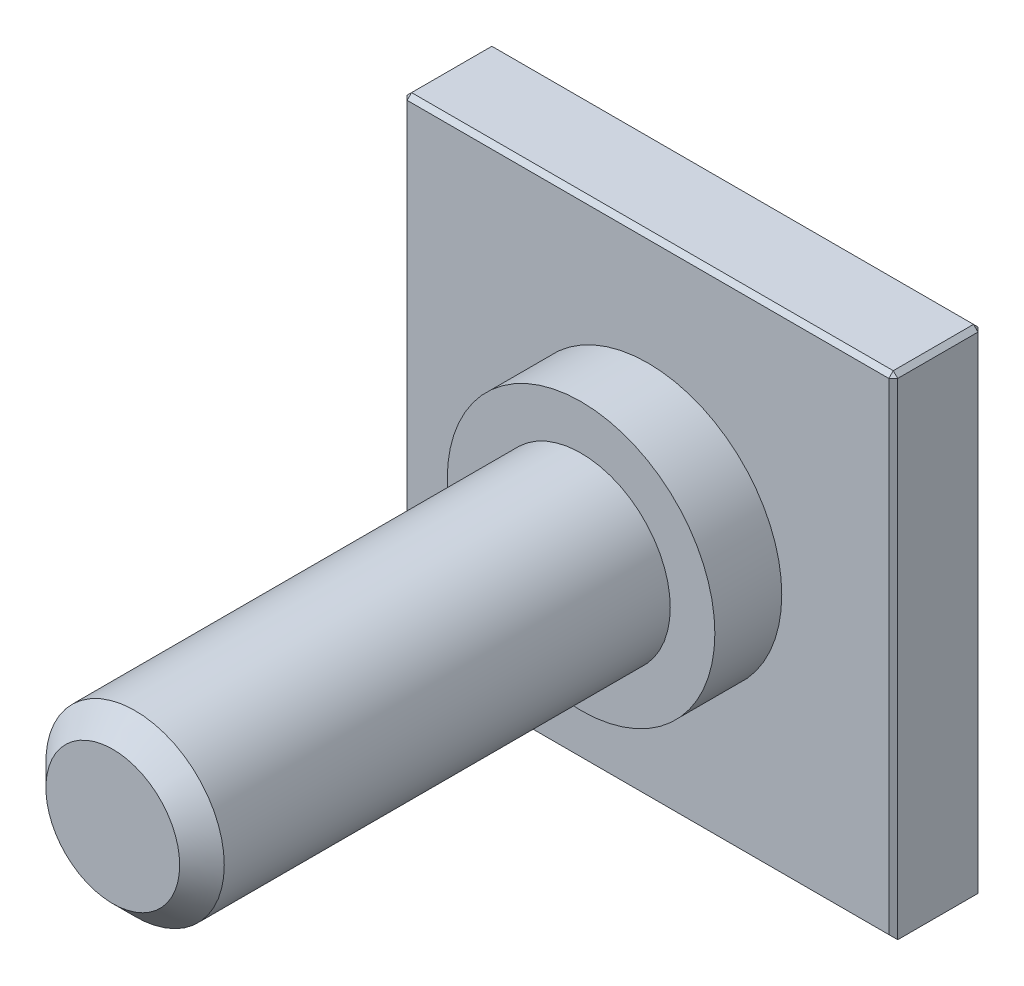
ISO-10303-21;
HEADER;
FILE_DESCRIPTION(('STEP AP214'),'2;1');
FILE_NAME('part.step','',(''),(''),'','','');
FILE_SCHEMA(('AUTOMOTIVE_DESIGN { 1 0 10303 214 1 1 1 1 }'));
ENDSEC;
DATA;
#1=APPLICATION_CONTEXT('core data for automotive mechanical design processes');
#2=APPLICATION_PROTOCOL_DEFINITION('international standard','automotive_design',2000,#1);
#3=PRODUCT_CONTEXT('',#1,'mechanical');
#4=PRODUCT('Part','Part','',(#3));
#5=PRODUCT_RELATED_PRODUCT_CATEGORY('part','',(#4));
#6=PRODUCT_DEFINITION_FORMATION('','',#4);
#7=PRODUCT_DEFINITION_CONTEXT('part definition',#1,'design');
#8=PRODUCT_DEFINITION('design','',#6,#7);
#9=PRODUCT_DEFINITION_SHAPE('','',#8);
#10=(LENGTH_UNIT() NAMED_UNIT(*) SI_UNIT(.MILLI.,.METRE.));
#11=(NAMED_UNIT(*) PLANE_ANGLE_UNIT() SI_UNIT($,.RADIAN.));
#12=(NAMED_UNIT(*) SI_UNIT($,.STERADIAN.) SOLID_ANGLE_UNIT());
#13=UNCERTAINTY_MEASURE_WITH_UNIT(LENGTH_MEASURE(1.E-05),#10,'distance_accuracy_value','');
#14=(GEOMETRIC_REPRESENTATION_CONTEXT(3) GLOBAL_UNCERTAINTY_ASSIGNED_CONTEXT((#13)) GLOBAL_UNIT_ASSIGNED_CONTEXT((#10,
#11,#12)) REPRESENTATION_CONTEXT('',''));
#15=CARTESIAN_POINT('',(0.,0.,0.));
#16=DIRECTION('',(0.,0.,1.));
#17=DIRECTION('',(1.,0.,0.));
#18=AXIS2_PLACEMENT_3D('',#15,#16,#17);
#19=CARTESIAN_POINT('',(5.5,-5.5,2.));
#20=DIRECTION('',(-1.,0.,0.));
#21=DIRECTION('',(0.,0.,1.));
#22=AXIS2_PLACEMENT_3D('',#19,#20,#21);
#23=PLANE('',#22);
#24=DIRECTION('',(0.,0.,-1.));
#25=VECTOR('',#24,1.);
#26=CARTESIAN_POINT('',(5.5,-5.5,2.));
#27=LINE('',#26,#25);
#28=CARTESIAN_POINT('',(5.5,-5.5,1.9));
#29=VERTEX_POINT('',#28);
#30=CARTESIAN_POINT('',(5.5,-5.5,0.100000000000001));
#31=VERTEX_POINT('',#30);
#32=EDGE_CURVE('E167',#29,#31,#27,.T.);
#33=ORIENTED_EDGE('',*,*,#32,.T.);
#34=DIRECTION('',(0.,1.,0.));
#35=VECTOR('',#34,1.);
#36=CARTESIAN_POINT('',(5.5,5.5,0.0999999999999994));
#37=LINE('',#36,#35);
#38=CARTESIAN_POINT('',(5.5,5.4,0.0999999999999994));
#39=VERTEX_POINT('',#38);
#40=EDGE_CURVE('E276',#31,#39,#37,.T.);
#41=ORIENTED_EDGE('',*,*,#40,.T.);
#42=DIRECTION('',(0.,0.,1.));
#43=VECTOR('',#42,1.);
#44=CARTESIAN_POINT('',(5.5,5.4,2.));
#45=LINE('',#44,#43);
#46=CARTESIAN_POINT('',(5.5,5.4,1.9));
#47=VERTEX_POINT('',#46);
#48=EDGE_CURVE('E273',#39,#47,#45,.T.);
#49=ORIENTED_EDGE('',*,*,#48,.T.);
#50=DIRECTION('',(0.,-1.,0.));
#51=VECTOR('',#50,1.);
#52=CARTESIAN_POINT('',(5.5,-5.5,1.9));
#53=LINE('',#52,#51);
#54=EDGE_CURVE('E269',#47,#29,#53,.T.);
#55=ORIENTED_EDGE('',*,*,#54,.T.);
#56=EDGE_LOOP('',(#33,#41,#49,#55));
#57=FACE_BOUND('',#56,.T.);
#58=ADVANCED_FACE('F34',(#57),#23,.F.);
#59=CARTESIAN_POINT('',(-5.5,5.5,2.));
#60=DIRECTION('',(0.,-1.,0.));
#61=DIRECTION('',(0.,0.,-1.));
#62=AXIS2_PLACEMENT_3D('',#59,#60,#61);
#63=PLANE('',#62);
#64=DIRECTION('',(1.,0.,0.));
#65=VECTOR('',#64,1.);
#66=CARTESIAN_POINT('',(-5.5,5.5,1.9));
#67=LINE('',#66,#65);
#68=CARTESIAN_POINT('',(-5.4,5.5,1.9));
#69=VERTEX_POINT('',#68);
#70=CARTESIAN_POINT('',(5.4,5.5,1.9));
#71=VERTEX_POINT('',#70);
#72=EDGE_CURVE('E120',#69,#71,#67,.T.);
#73=ORIENTED_EDGE('',*,*,#72,.T.);
#74=DIRECTION('',(0.,0.,-1.));
#75=VECTOR('',#74,1.);
#76=CARTESIAN_POINT('',(5.4,5.5,2.));
#77=LINE('',#76,#75);
#78=CARTESIAN_POINT('',(5.4,5.5,0.100000000000001));
#79=VERTEX_POINT('',#78);
#80=EDGE_CURVE('E116',#71,#79,#77,.T.);
#81=ORIENTED_EDGE('',*,*,#80,.T.);
#82=DIRECTION('',(-1.,0.,0.));
#83=VECTOR('',#82,1.);
#84=CARTESIAN_POINT('',(-5.5,5.5,0.100000000000001));
#85=LINE('',#84,#83);
#86=CARTESIAN_POINT('',(-5.4,5.5,0.100000000000001));
#87=VERTEX_POINT('',#86);
#88=EDGE_CURVE('E110',#79,#87,#85,.T.);
#89=ORIENTED_EDGE('',*,*,#88,.T.);
#90=DIRECTION('',(0.,0.,1.));
#91=VECTOR('',#90,1.);
#92=CARTESIAN_POINT('',(-5.4,5.5,2.));
#93=LINE('',#92,#91);
#94=EDGE_CURVE('E113',#87,#69,#93,.T.);
#95=ORIENTED_EDGE('',*,*,#94,.T.);
#96=EDGE_LOOP('',(#73,#81,#89,#95));
#97=FACE_BOUND('',#96,.T.);
#98=ADVANCED_FACE('F112',(#97),#63,.F.);
#99=CARTESIAN_POINT('',(-5.5,-5.5,2.));
#100=DIRECTION('',(1.,0.,0.));
#101=DIRECTION('',(0.,0.,-1.));
#102=AXIS2_PLACEMENT_3D('',#99,#100,#101);
#103=PLANE('',#102);
#104=DIRECTION('',(0.,0.,-1.));
#105=VECTOR('',#104,1.);
#106=CARTESIAN_POINT('',(-5.5,5.4,2.));
#107=LINE('',#106,#105);
#108=CARTESIAN_POINT('',(-5.5,5.4,1.9));
#109=VERTEX_POINT('',#108);
#110=CARTESIAN_POINT('',(-5.5,5.4,0.100000000000001));
#111=VERTEX_POINT('',#110);
#112=EDGE_CURVE('E49',#109,#111,#107,.T.);
#113=ORIENTED_EDGE('',*,*,#112,.T.);
#114=DIRECTION('',(0.,-1.,0.));
#115=VECTOR('',#114,1.);
#116=CARTESIAN_POINT('',(-5.5,-5.5,0.100000000000001));
#117=LINE('',#116,#115);
#118=CARTESIAN_POINT('',(-5.5,-5.5,0.100000000000001));
#119=VERTEX_POINT('',#118);
#120=EDGE_CURVE('E175',#111,#119,#117,.T.);
#121=ORIENTED_EDGE('',*,*,#120,.T.);
#122=DIRECTION('',(0.,0.,-1.));
#123=VECTOR('',#122,1.);
#124=CARTESIAN_POINT('',(-5.5,-5.5,2.));
#125=LINE('',#124,#123);
#126=CARTESIAN_POINT('',(-5.5,-5.5,1.9));
#127=VERTEX_POINT('',#126);
#128=EDGE_CURVE('E131',#127,#119,#125,.T.);
#129=ORIENTED_EDGE('',*,*,#128,.F.);
#130=DIRECTION('',(0.,1.,0.));
#131=VECTOR('',#130,1.);
#132=CARTESIAN_POINT('',(-5.5,-5.5,1.9));
#133=LINE('',#132,#131);
#134=EDGE_CURVE('E54',#127,#109,#133,.T.);
#135=ORIENTED_EDGE('',*,*,#134,.T.);
#136=EDGE_LOOP('',(#113,#121,#129,#135));
#137=FACE_BOUND('',#136,.T.);
#138=ADVANCED_FACE('F196',(#137),#103,.F.);
#139=CARTESIAN_POINT('',(-5.5,-5.5,2.));
#140=DIRECTION('',(0.,1.,0.));
#141=DIRECTION('',(0.,0.,1.));
#142=AXIS2_PLACEMENT_3D('',#139,#140,#141);
#143=PLANE('',#142);
#144=ORIENTED_EDGE('',*,*,#128,.T.);
#145=DIRECTION('',(1.,0.,0.));
#146=VECTOR('',#145,1.);
#147=CARTESIAN_POINT('',(5.5,-5.5,0.100000000000001));
#148=LINE('',#147,#146);
#149=EDGE_CURVE('E294',#119,#31,#148,.T.);
#150=ORIENTED_EDGE('',*,*,#149,.T.);
#151=ORIENTED_EDGE('',*,*,#32,.F.);
#152=DIRECTION('',(-1.,0.,0.));
#153=VECTOR('',#152,1.);
#154=CARTESIAN_POINT('',(-5.5,-5.5,1.9));
#155=LINE('',#154,#153);
#156=EDGE_CURVE('E292',#29,#127,#155,.T.);
#157=ORIENTED_EDGE('',*,*,#156,.T.);
#158=EDGE_LOOP('',(#144,#150,#151,#157));
#159=FACE_BOUND('',#158,.T.);
#160=ADVANCED_FACE('F325',(#159),#143,.F.);
#161=CARTESIAN_POINT('',(0.,0.,2.));
#162=DIRECTION('',(0.,0.,-1.));
#163=DIRECTION('',(-1.,0.,0.));
#164=AXIS2_PLACEMENT_3D('',#161,#162,#163);
#165=PLANE('',#164);
#166=CARTESIAN_POINT('',(0.,0.,2.));
#167=DIRECTION('',(0.,0.,-1.));
#168=DIRECTION('',(-1.,0.,0.));
#169=AXIS2_PLACEMENT_3D('',#166,#167,#168);
#170=CIRCLE('',#169,3.);
#171=CARTESIAN_POINT('',(-3.,0.,2.));
#172=VERTEX_POINT('',#171);
#173=EDGE_CURVE('E173',#172,#172,#170,.F.);
#174=ORIENTED_EDGE('',*,*,#173,.F.);
#175=EDGE_LOOP('',(#174));
#176=FACE_BOUND('',#175,.T.);
#177=DIRECTION('',(0.,1.,0.));
#178=VECTOR('',#177,1.);
#179=CARTESIAN_POINT('',(5.4,0.,2.));
#180=LINE('',#179,#178);
#181=CARTESIAN_POINT('',(5.4,-5.4,2.));
#182=VERTEX_POINT('',#181);
#183=CARTESIAN_POINT('',(5.4,5.4,2.));
#184=VERTEX_POINT('',#183);
#185=EDGE_CURVE('E278',#182,#184,#180,.T.);
#186=ORIENTED_EDGE('',*,*,#185,.T.);
#187=DIRECTION('',(-1.,0.,0.));
#188=VECTOR('',#187,1.);
#189=CARTESIAN_POINT('',(0.,5.4,2.));
#190=LINE('',#189,#188);
#191=CARTESIAN_POINT('',(-5.4,5.4,2.));
#192=VERTEX_POINT('',#191);
#193=EDGE_CURVE('E283',#184,#192,#190,.T.);
#194=ORIENTED_EDGE('',*,*,#193,.T.);
#195=DIRECTION('',(0.,-1.,0.));
#196=VECTOR('',#195,1.);
#197=CARTESIAN_POINT('',(-5.4,0.,2.));
#198=LINE('',#197,#196);
#199=CARTESIAN_POINT('',(-5.4,-5.4,2.));
#200=VERTEX_POINT('',#199);
#201=EDGE_CURVE('E260',#192,#200,#198,.T.);
#202=ORIENTED_EDGE('',*,*,#201,.T.);
#203=DIRECTION('',(1.,0.,0.));
#204=VECTOR('',#203,1.);
#205=CARTESIAN_POINT('',(0.,-5.4,2.));
#206=LINE('',#205,#204);
#207=EDGE_CURVE('E280',#200,#182,#206,.T.);
#208=ORIENTED_EDGE('',*,*,#207,.T.);
#209=EDGE_LOOP('',(#186,#194,#202,#208));
#210=FACE_BOUND('',#209,.T.);
#211=ADVANCED_FACE('F254',(#176,#210),#165,.F.);
#212=CARTESIAN_POINT('',(0.,0.,0.));
#213=DIRECTION('',(0.,0.,-1.));
#214=DIRECTION('',(-1.,0.,0.));
#215=AXIS2_PLACEMENT_3D('',#212,#213,#214);
#216=PLANE('',#215);
#217=DIRECTION('',(0.,1.,0.));
#218=VECTOR('',#217,1.);
#219=CARTESIAN_POINT('',(-5.4,5.5,0.));
#220=LINE('',#219,#218);
#221=CARTESIAN_POINT('',(-5.4,-5.4,0.));
#222=VERTEX_POINT('',#221);
#223=CARTESIAN_POINT('',(-5.4,5.4,0.));
#224=VERTEX_POINT('',#223);
#225=EDGE_CURVE('E285',#222,#224,#220,.T.);
#226=ORIENTED_EDGE('',*,*,#225,.T.);
#227=DIRECTION('',(1.,0.,0.));
#228=VECTOR('',#227,1.);
#229=CARTESIAN_POINT('',(5.5,5.4,0.));
#230=LINE('',#229,#228);
#231=CARTESIAN_POINT('',(5.4,5.4,0.));
#232=VERTEX_POINT('',#231);
#233=EDGE_CURVE('E143',#224,#232,#230,.T.);
#234=ORIENTED_EDGE('',*,*,#233,.T.);
#235=DIRECTION('',(0.,-1.,0.));
#236=VECTOR('',#235,1.);
#237=CARTESIAN_POINT('',(5.4,-5.5,0.));
#238=LINE('',#237,#236);
#239=CARTESIAN_POINT('',(5.4,-5.4,0.));
#240=VERTEX_POINT('',#239);
#241=EDGE_CURVE('E289',#232,#240,#238,.T.);
#242=ORIENTED_EDGE('',*,*,#241,.T.);
#243=DIRECTION('',(-1.,0.,0.));
#244=VECTOR('',#243,1.);
#245=CARTESIAN_POINT('',(-5.5,-5.4,0.));
#246=LINE('',#245,#244);
#247=EDGE_CURVE('E287',#240,#222,#246,.T.);
#248=ORIENTED_EDGE('',*,*,#247,.T.);
#249=EDGE_LOOP('',(#226,#234,#242,#248));
#250=FACE_BOUND('',#249,.T.);
#251=ADVANCED_FACE('F249',(#250),#216,.T.);
#252=CARTESIAN_POINT('',(-5.4,0.,2.));
#253=DIRECTION('',(0.707106781186541,0.,-0.707106781186554));
#254=DIRECTION('',(0.,-1.,0.));
#255=AXIS2_PLACEMENT_3D('',#252,#253,#254);
#256=PLANE('',#255);
#257=DIRECTION('',(-0.707106781186554,0.,-0.707106781186541));
#258=VECTOR('',#257,1.);
#259=CARTESIAN_POINT('',(-5.4,5.4,2.));
#260=LINE('',#259,#258);
#261=EDGE_CURVE('E161',#109,#192,#260,.F.);
#262=ORIENTED_EDGE('',*,*,#261,.F.);
#263=ORIENTED_EDGE('',*,*,#134,.F.);
#264=DIRECTION('',(-0.577350269189629,-0.577350269189629,-0.577350269189619));
#265=VECTOR('',#264,1.);
#266=CARTESIAN_POINT('',(-3.59999999999998,-3.59999999999998,3.79999999999999));
#267=LINE('',#266,#265);
#268=EDGE_CURVE('E164',#200,#127,#267,.T.);
#269=ORIENTED_EDGE('',*,*,#268,.F.);
#270=ORIENTED_EDGE('',*,*,#201,.F.);
#271=EDGE_LOOP('',(#262,#263,#269,#270));
#272=FACE_BOUND('',#271,.T.);
#273=ADVANCED_FACE('F247',(#272),#256,.F.);
#274=CARTESIAN_POINT('',(-5.5,5.4,2.));
#275=DIRECTION('',(0.707106781186551,-0.707106781186544,0.));
#276=DIRECTION('',(0.,0.,-1.));
#277=AXIS2_PLACEMENT_3D('',#274,#275,#276);
#278=PLANE('',#277);
#279=DIRECTION('',(-0.707106781186544,-0.707106781186551,0.));
#280=VECTOR('',#279,1.);
#281=CARTESIAN_POINT('',(-5.4,5.5,0.100000000000001));
#282=LINE('',#281,#280);
#283=EDGE_CURVE('E126',#111,#87,#282,.F.);
#284=ORIENTED_EDGE('',*,*,#283,.F.);
#285=ORIENTED_EDGE('',*,*,#112,.F.);
#286=DIRECTION('',(0.707106781186544,0.707106781186551,0.));
#287=VECTOR('',#286,1.);
#288=CARTESIAN_POINT('',(-5.45,5.45,1.9));
#289=LINE('',#288,#287);
#290=EDGE_CURVE('E129',#69,#109,#289,.F.);
#291=ORIENTED_EDGE('',*,*,#290,.F.);
#292=ORIENTED_EDGE('',*,*,#94,.F.);
#293=EDGE_LOOP('',(#284,#285,#291,#292));
#294=FACE_BOUND('',#293,.T.);
#295=ADVANCED_FACE('F125',(#294),#278,.F.);
#296=CARTESIAN_POINT('',(-5.5,-5.5,0.100000000000001));
#297=DIRECTION('',(-0.707106781186554,0.,-0.707106781186541));
#298=DIRECTION('',(0.,1.,0.));
#299=AXIS2_PLACEMENT_3D('',#296,#297,#298);
#300=PLANE('',#299);
#301=DIRECTION('',(-0.577350269189622,-0.577350269189622,0.577350269189632));
#302=VECTOR('',#301,1.);
#303=CARTESIAN_POINT('',(-5.5,-5.5,0.100000000000001));
#304=LINE('',#303,#302);
#305=EDGE_CURVE('E156',#119,#222,#304,.F.);
#306=ORIENTED_EDGE('',*,*,#305,.F.);
#307=ORIENTED_EDGE('',*,*,#120,.F.);
#308=DIRECTION('',(-0.707106781186541,0.,0.707106781186554));
#309=VECTOR('',#308,1.);
#310=CARTESIAN_POINT('',(-5.45,5.4,0.050000000000001));
#311=LINE('',#310,#309);
#312=EDGE_CURVE('E139',#224,#111,#311,.T.);
#313=ORIENTED_EDGE('',*,*,#312,.F.);
#314=ORIENTED_EDGE('',*,*,#225,.F.);
#315=EDGE_LOOP('',(#306,#307,#313,#314));
#316=FACE_BOUND('',#315,.T.);
#317=ADVANCED_FACE('F241',(#316),#300,.T.);
#318=CARTESIAN_POINT('',(0.,-5.4,2.));
#319=DIRECTION('',(0.,0.707106781186541,-0.707106781186554));
#320=DIRECTION('',(1.,0.,0.));
#321=AXIS2_PLACEMENT_3D('',#318,#319,#320);
#322=PLANE('',#321);
#323=ORIENTED_EDGE('',*,*,#268,.T.);
#324=ORIENTED_EDGE('',*,*,#156,.F.);
#325=DIRECTION('',(0.577350269189629,-0.577350269189629,-0.577350269189619));
#326=VECTOR('',#325,1.);
#327=CARTESIAN_POINT('',(3.59999999999998,-3.59999999999998,3.79999999999999));
#328=LINE('',#327,#326);
#329=EDGE_CURVE('E147',#182,#29,#328,.T.);
#330=ORIENTED_EDGE('',*,*,#329,.F.);
#331=ORIENTED_EDGE('',*,*,#207,.F.);
#332=EDGE_LOOP('',(#323,#324,#330,#331));
#333=FACE_BOUND('',#332,.T.);
#334=ADVANCED_FACE('F237',(#333),#322,.F.);
#335=CARTESIAN_POINT('',(-5.4,5.4,2.));
#336=DIRECTION('',(-0.577350269189623,0.577350269189617,0.577350269189637));
#337=DIRECTION('',(0.707106781186557,0.,0.707106781186538));
#338=AXIS2_PLACEMENT_3D('',#335,#336,#337);
#339=PLANE('',#338);
#340=ORIENTED_EDGE('',*,*,#290,.T.);
#341=ORIENTED_EDGE('',*,*,#261,.T.);
#342=DIRECTION('',(0.,-0.707106781186554,0.707106781186541));
#343=VECTOR('',#342,1.);
#344=CARTESIAN_POINT('',(-5.4,5.4,2.));
#345=LINE('',#344,#343);
#346=EDGE_CURVE('E144',#69,#192,#345,.T.);
#347=ORIENTED_EDGE('',*,*,#346,.F.);
#348=EDGE_LOOP('',(#340,#341,#347));
#349=FACE_BOUND('',#348,.T.);
#350=ADVANCED_FACE('F234',(#349),#339,.T.);
#351=CARTESIAN_POINT('',(-5.4,5.5,0.100000000000001));
#352=DIRECTION('',(-0.577350269189632,0.577350269189627,-0.577350269189617));
#353=DIRECTION('',(-0.707106781186544,-0.707106781186551,0.));
#354=AXIS2_PLACEMENT_3D('',#351,#352,#353);
#355=PLANE('',#354);
#356=ORIENTED_EDGE('',*,*,#312,.T.);
#357=ORIENTED_EDGE('',*,*,#283,.T.);
#358=DIRECTION('',(0.,-0.707106781186541,-0.707106781186554));
#359=VECTOR('',#358,1.);
#360=CARTESIAN_POINT('',(-5.4,5.5,0.100000000000001));
#361=LINE('',#360,#359);
#362=EDGE_CURVE('E136',#224,#87,#361,.F.);
#363=ORIENTED_EDGE('',*,*,#362,.F.);
#364=EDGE_LOOP('',(#356,#357,#363));
#365=FACE_BOUND('',#364,.T.);
#366=ADVANCED_FACE('F135',(#365),#355,.T.);
#367=CARTESIAN_POINT('',(-5.5,-5.5,0.100000000000001));
#368=DIRECTION('',(0.,-0.707106781186554,-0.707106781186541));
#369=DIRECTION('',(-1.,0.,0.));
#370=AXIS2_PLACEMENT_3D('',#367,#368,#369);
#371=PLANE('',#370);
#372=ORIENTED_EDGE('',*,*,#305,.T.);
#373=ORIENTED_EDGE('',*,*,#247,.F.);
#374=DIRECTION('',(0.577350269189636,-0.577350269189616,0.577350269189626));
#375=VECTOR('',#374,1.);
#376=CARTESIAN_POINT('',(1.83333333333321,-1.83333333333333,-3.56666666666673));
#377=LINE('',#376,#375);
#378=EDGE_CURVE('E145',#31,#240,#377,.F.);
#379=ORIENTED_EDGE('',*,*,#378,.F.);
#380=ORIENTED_EDGE('',*,*,#149,.F.);
#381=EDGE_LOOP('',(#372,#373,#379,#380));
#382=FACE_BOUND('',#381,.T.);
#383=ADVANCED_FACE('F227',(#382),#371,.T.);
#384=CARTESIAN_POINT('',(5.4,0.,2.));
#385=DIRECTION('',(-0.707106781186541,0.,-0.707106781186554));
#386=DIRECTION('',(0.,1.,0.));
#387=AXIS2_PLACEMENT_3D('',#384,#385,#386);
#388=PLANE('',#387);
#389=ORIENTED_EDGE('',*,*,#329,.T.);
#390=ORIENTED_EDGE('',*,*,#54,.F.);
#391=DIRECTION('',(-0.707106781186554,0.,0.707106781186541));
#392=VECTOR('',#391,1.);
#393=CARTESIAN_POINT('',(5.5,5.4,1.9));
#394=LINE('',#393,#392);
#395=EDGE_CURVE('E150',#184,#47,#394,.F.);
#396=ORIENTED_EDGE('',*,*,#395,.F.);
#397=ORIENTED_EDGE('',*,*,#185,.F.);
#398=EDGE_LOOP('',(#389,#390,#396,#397));
#399=FACE_BOUND('',#398,.T.);
#400=ADVANCED_FACE('F223',(#399),#388,.F.);
#401=CARTESIAN_POINT('',(0.,5.4,2.));
#402=DIRECTION('',(0.,-0.707106781186541,-0.707106781186554));
#403=DIRECTION('',(-1.,0.,0.));
#404=AXIS2_PLACEMENT_3D('',#401,#402,#403);
#405=PLANE('',#404);
#406=ORIENTED_EDGE('',*,*,#346,.T.);
#407=ORIENTED_EDGE('',*,*,#193,.F.);
#408=DIRECTION('',(0.,0.707106781186554,-0.707106781186541));
#409=VECTOR('',#408,1.);
#410=CARTESIAN_POINT('',(5.4,5.45,1.95));
#411=LINE('',#410,#409);
#412=EDGE_CURVE('E266',#71,#184,#411,.F.);
#413=ORIENTED_EDGE('',*,*,#412,.F.);
#414=ORIENTED_EDGE('',*,*,#72,.F.);
#415=EDGE_LOOP('',(#406,#407,#413,#414));
#416=FACE_BOUND('',#415,.T.);
#417=ADVANCED_FACE('F220',(#416),#405,.F.);
#418=CARTESIAN_POINT('',(-5.5,5.5,0.100000000000001));
#419=DIRECTION('',(0.,0.707106781186554,-0.707106781186541));
#420=DIRECTION('',(1.,0.,0.));
#421=AXIS2_PLACEMENT_3D('',#418,#419,#420);
#422=PLANE('',#421);
#423=ORIENTED_EDGE('',*,*,#362,.T.);
#424=ORIENTED_EDGE('',*,*,#88,.F.);
#425=DIRECTION('',(0.,0.707106781186541,0.707106781186554));
#426=VECTOR('',#425,1.);
#427=CARTESIAN_POINT('',(5.4,5.5,0.100000000000001));
#428=LINE('',#427,#426);
#429=EDGE_CURVE('E304',#232,#79,#428,.T.);
#430=ORIENTED_EDGE('',*,*,#429,.F.);
#431=ORIENTED_EDGE('',*,*,#233,.F.);
#432=EDGE_LOOP('',(#423,#424,#430,#431));
#433=FACE_BOUND('',#432,.T.);
#434=ADVANCED_FACE('F141',(#433),#422,.T.);
#435=CARTESIAN_POINT('',(5.5,-5.5,0.0999999999999994));
#436=DIRECTION('',(0.707106781186541,0.,-0.707106781186554));
#437=DIRECTION('',(0.,-1.,0.));
#438=AXIS2_PLACEMENT_3D('',#435,#436,#437);
#439=PLANE('',#438);
#440=ORIENTED_EDGE('',*,*,#378,.T.);
#441=ORIENTED_EDGE('',*,*,#241,.F.);
#442=DIRECTION('',(-0.707106781186554,0.,-0.707106781186541));
#443=VECTOR('',#442,1.);
#444=CARTESIAN_POINT('',(5.45,5.4,0.0499999999999993));
#445=LINE('',#444,#443);
#446=EDGE_CURVE('E302',#39,#232,#445,.T.);
#447=ORIENTED_EDGE('',*,*,#446,.F.);
#448=ORIENTED_EDGE('',*,*,#40,.F.);
#449=EDGE_LOOP('',(#440,#441,#447,#448));
#450=FACE_BOUND('',#449,.T.);
#451=ADVANCED_FACE('F213',(#450),#439,.T.);
#452=CARTESIAN_POINT('',(5.5,5.4,1.9));
#453=DIRECTION('',(0.577350269189619,0.577350269189624,0.577350269189634));
#454=DIRECTION('',(0.,-0.707106781186554,0.707106781186541));
#455=AXIS2_PLACEMENT_3D('',#452,#453,#454);
#456=PLANE('',#455);
#457=ORIENTED_EDGE('',*,*,#412,.T.);
#458=ORIENTED_EDGE('',*,*,#395,.T.);
#459=DIRECTION('',(0.70710678118655,-0.707106781186544,0.));
#460=VECTOR('',#459,1.);
#461=CARTESIAN_POINT('',(5.5,5.4,1.9));
#462=LINE('',#461,#460);
#463=EDGE_CURVE('E300',#71,#47,#462,.T.);
#464=ORIENTED_EDGE('',*,*,#463,.F.);
#465=EDGE_LOOP('',(#457,#458,#464));
#466=FACE_BOUND('',#465,.T.);
#467=ADVANCED_FACE('F209',(#466),#456,.T.);
#468=CARTESIAN_POINT('',(5.4,5.5,0.100000000000001));
#469=DIRECTION('',(0.577350269189619,0.577350269189634,-0.577350269189624));
#470=DIRECTION('',(0.,0.707106781186541,0.707106781186554));
#471=AXIS2_PLACEMENT_3D('',#468,#469,#470);
#472=PLANE('',#471);
#473=ORIENTED_EDGE('',*,*,#446,.T.);
#474=ORIENTED_EDGE('',*,*,#429,.T.);
#475=DIRECTION('',(-0.707106781186551,0.707106781186544,0.));
#476=VECTOR('',#475,1.);
#477=CARTESIAN_POINT('',(5.4,5.5,0.100000000000001));
#478=LINE('',#477,#476);
#479=EDGE_CURVE('E171',#39,#79,#478,.T.);
#480=ORIENTED_EDGE('',*,*,#479,.F.);
#481=EDGE_LOOP('',(#473,#474,#480));
#482=FACE_BOUND('',#481,.T.);
#483=ADVANCED_FACE('F205',(#482),#472,.T.);
#484=CARTESIAN_POINT('',(5.4,5.5,2.));
#485=DIRECTION('',(-0.707106781186544,-0.707106781186551,0.));
#486=DIRECTION('',(0.,0.,-1.));
#487=AXIS2_PLACEMENT_3D('',#484,#485,#486);
#488=PLANE('',#487);
#489=ORIENTED_EDGE('',*,*,#463,.T.);
#490=ORIENTED_EDGE('',*,*,#48,.F.);
#491=ORIENTED_EDGE('',*,*,#479,.T.);
#492=ORIENTED_EDGE('',*,*,#80,.F.);
#493=EDGE_LOOP('',(#489,#490,#491,#492));
#494=FACE_BOUND('',#493,.T.);
#495=ADVANCED_FACE('F201',(#494),#488,.F.);
#496=CARTESIAN_POINT('',(0.,0.,3.5));
#497=DIRECTION('',(0.,0.,-1.));
#498=DIRECTION('',(-1.,0.,0.));
#499=AXIS2_PLACEMENT_3D('',#496,#497,#498);
#500=CYLINDRICAL_SURFACE('',#499,3.);
#501=CARTESIAN_POINT('',(0.,0.,3.5));
#502=DIRECTION('',(0.,0.,1.));
#503=DIRECTION('',(1.,0.,0.));
#504=AXIS2_PLACEMENT_3D('',#501,#502,#503);
#505=CIRCLE('',#504,3.);
#506=CARTESIAN_POINT('',(3.,0.,3.5));
#507=VERTEX_POINT('',#506);
#508=EDGE_CURVE('E172',#507,#507,#505,.T.);
#509=ORIENTED_EDGE('',*,*,#508,.F.);
#510=EDGE_LOOP('',(#509));
#511=FACE_BOUND('',#510,.T.);
#512=ORIENTED_EDGE('',*,*,#173,.T.);
#513=EDGE_LOOP('',(#512));
#514=FACE_BOUND('',#513,.T.);
#515=ADVANCED_FACE('F204',(#511,#514),#500,.T.);
#516=CARTESIAN_POINT('',(0.,0.,3.5));
#517=DIRECTION('',(0.,0.,1.));
#518=DIRECTION('',(1.,0.,0.));
#519=AXIS2_PLACEMENT_3D('',#516,#517,#518);
#520=PLANE('',#519);
#521=CARTESIAN_POINT('',(0.,0.,3.5));
#522=DIRECTION('',(0.,0.,1.));
#523=DIRECTION('',(1.,0.,0.));
#524=AXIS2_PLACEMENT_3D('',#521,#522,#523);
#525=CIRCLE('',#524,2.);
#526=CARTESIAN_POINT('',(2.,0.,3.5));
#527=VERTEX_POINT('',#526);
#528=EDGE_CURVE('E168',#527,#527,#525,.T.);
#529=ORIENTED_EDGE('',*,*,#528,.F.);
#530=EDGE_LOOP('',(#529));
#531=FACE_BOUND('',#530,.T.);
#532=ORIENTED_EDGE('',*,*,#508,.T.);
#533=EDGE_LOOP('',(#532));
#534=FACE_BOUND('',#533,.T.);
#535=ADVANCED_FACE('F333',(#531,#534),#520,.T.);
#536=CARTESIAN_POINT('',(0.,0.,14.));
#537=DIRECTION('',(0.,0.,1.));
#538=DIRECTION('',(1.,0.,0.));
#539=AXIS2_PLACEMENT_3D('',#536,#537,#538);
#540=PLANE('',#539);
#541=CARTESIAN_POINT('',(0.,0.,14.));
#542=DIRECTION('',(0.,0.,1.));
#543=DIRECTION('',(1.,0.,0.));
#544=AXIS2_PLACEMENT_3D('',#541,#542,#543);
#545=CIRCLE('',#544,1.50000000000001);
#546=CARTESIAN_POINT('',(1.50000000000001,0.,14.));
#547=VERTEX_POINT('',#546);
#548=EDGE_CURVE('E42',#547,#547,#545,.T.);
#549=ORIENTED_EDGE('',*,*,#548,.T.);
#550=EDGE_LOOP('',(#549));
#551=FACE_BOUND('',#550,.T.);
#552=ADVANCED_FACE('F179',(#551),#540,.T.);
#553=CARTESIAN_POINT('',(0.,0.,14.));
#554=DIRECTION('',(0.,0.,-1.));
#555=DIRECTION('',(-1.,0.,0.));
#556=AXIS2_PLACEMENT_3D('',#553,#554,#555);
#557=CYLINDRICAL_SURFACE('',#556,2.);
#558=CARTESIAN_POINT('',(0.,0.,13.5));
#559=DIRECTION('',(0.,0.,1.));
#560=DIRECTION('',(1.,0.,0.));
#561=AXIS2_PLACEMENT_3D('',#558,#559,#560);
#562=CIRCLE('',#561,2.);
#563=CARTESIAN_POINT('',(2.,0.,13.5));
#564=VERTEX_POINT('',#563);
#565=EDGE_CURVE('E11',#564,#564,#562,.F.);
#566=ORIENTED_EDGE('',*,*,#565,.T.);
#567=EDGE_LOOP('',(#566));
#568=FACE_BOUND('',#567,.T.);
#569=ORIENTED_EDGE('',*,*,#528,.T.);
#570=EDGE_LOOP('',(#569));
#571=FACE_BOUND('',#570,.T.);
#572=ADVANCED_FACE('F182',(#568,#571),#557,.T.);
#573=CARTESIAN_POINT('',(0.,0.,14.));
#574=DIRECTION('',(0.,0.,-1.));
#575=DIRECTION('',(-1.,0.,0.));
#576=AXIS2_PLACEMENT_3D('',#573,#574,#575);
#577=CONICAL_SURFACE('',#576,1.50000000000001,0.785398163397448);
#578=ORIENTED_EDGE('',*,*,#565,.F.);
#579=EDGE_LOOP('',(#578));
#580=FACE_BOUND('',#579,.T.);
#581=ORIENTED_EDGE('',*,*,#548,.F.);
#582=EDGE_LOOP('',(#581));
#583=FACE_BOUND('',#582,.T.);
#584=ADVANCED_FACE('F36',(#580,#583),#577,.T.);
#585=CLOSED_SHELL('',(#58,#98,#138,#160,#211,#251,#273,#295,#317,#334,#350,#366,#383,#400,#417,
#434,#451,#467,#483,#495,#515,#535,#552,#572,#584));
#586=MANIFOLD_SOLID_BREP('B2',#585);
#587=ADVANCED_BREP_SHAPE_REPRESENTATION('',(#18,#586),#14);
#588=SHAPE_DEFINITION_REPRESENTATION(#9,#587);
ENDSEC;
END-ISO-10303-21;
